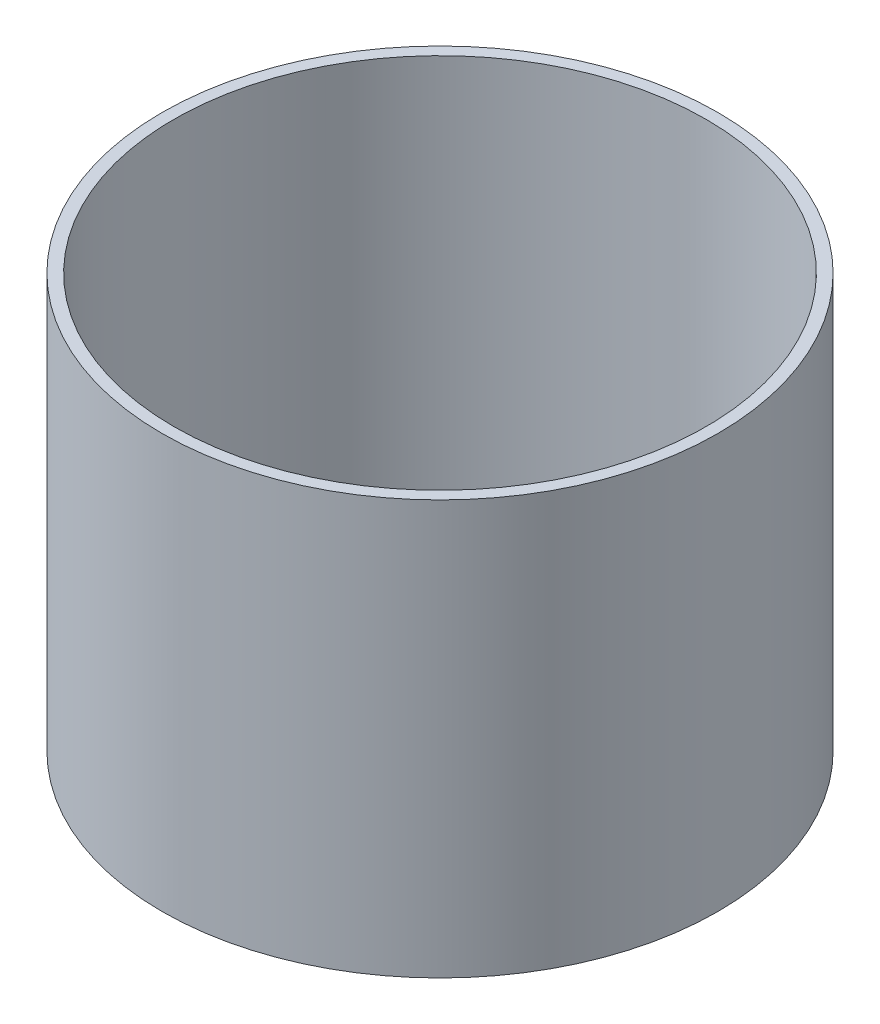
ISO-10303-21;
HEADER;
FILE_DESCRIPTION(('STEP AP214'),'2;1');
FILE_NAME('part.step','',(''),(''),'','','');
FILE_SCHEMA(('AUTOMOTIVE_DESIGN { 1 0 10303 214 1 1 1 1 }'));
ENDSEC;
DATA;
#1=APPLICATION_CONTEXT('core data for automotive mechanical design processes');
#2=APPLICATION_PROTOCOL_DEFINITION('international standard','automotive_design',2000,#1);
#3=PRODUCT_CONTEXT('',#1,'mechanical');
#4=PRODUCT('Part','Part','',(#3));
#5=PRODUCT_RELATED_PRODUCT_CATEGORY('part','',(#4));
#6=PRODUCT_DEFINITION_FORMATION('','',#4);
#7=PRODUCT_DEFINITION_CONTEXT('part definition',#1,'design');
#8=PRODUCT_DEFINITION('design','',#6,#7);
#9=PRODUCT_DEFINITION_SHAPE('','',#8);
#10=(LENGTH_UNIT() NAMED_UNIT(*) SI_UNIT(.MILLI.,.METRE.));
#11=(NAMED_UNIT(*) PLANE_ANGLE_UNIT() SI_UNIT($,.RADIAN.));
#12=(NAMED_UNIT(*) SI_UNIT($,.STERADIAN.) SOLID_ANGLE_UNIT());
#13=UNCERTAINTY_MEASURE_WITH_UNIT(LENGTH_MEASURE(1.E-05),#10,'distance_accuracy_value','');
#14=(GEOMETRIC_REPRESENTATION_CONTEXT(3) GLOBAL_UNCERTAINTY_ASSIGNED_CONTEXT((#13)) GLOBAL_UNIT_ASSIGNED_CONTEXT((#10,
#11,#12)) REPRESENTATION_CONTEXT('',''));
#15=CARTESIAN_POINT('',(0.,0.,0.));
#16=DIRECTION('',(0.,0.,1.));
#17=DIRECTION('',(1.,0.,0.));
#18=AXIS2_PLACEMENT_3D('',#15,#16,#17);
#19=CARTESIAN_POINT('',(0.,177.8,0.));
#20=DIRECTION('',(0.,1.,0.));
#21=DIRECTION('',(0.,0.,1.));
#22=AXIS2_PLACEMENT_3D('',#19,#20,#21);
#23=PLANE('',#22);
#24=CARTESIAN_POINT('',(0.,177.8,0.));
#25=DIRECTION('',(0.,1.,0.));
#26=DIRECTION('',(0.,0.,1.));
#27=AXIS2_PLACEMENT_3D('',#24,#25,#26);
#28=CIRCLE('',#27,119.38);
#29=CARTESIAN_POINT('',(0.,177.8,119.38));
#30=VERTEX_POINT('',#29);
#31=EDGE_CURVE('E11',#30,#30,#28,.T.);
#32=ORIENTED_EDGE('',*,*,#31,.T.);
#33=EDGE_LOOP('',(#32));
#34=FACE_BOUND('',#33,.T.);
#35=CARTESIAN_POINT('',(0.,177.8,0.));
#36=DIRECTION('',(0.,1.,0.));
#37=DIRECTION('',(0.,0.,1.));
#38=AXIS2_PLACEMENT_3D('',#35,#36,#37);
#39=CIRCLE('',#38,114.3);
#40=CARTESIAN_POINT('',(0.,177.8,114.3));
#41=VERTEX_POINT('',#40);
#42=EDGE_CURVE('E49',#41,#41,#39,.T.);
#43=ORIENTED_EDGE('',*,*,#42,.F.);
#44=EDGE_LOOP('',(#43));
#45=FACE_BOUND('',#44,.T.);
#46=ADVANCED_FACE('F38',(#34,#45),#23,.T.);
#47=CARTESIAN_POINT('',(0.,0.,0.));
#48=DIRECTION('',(0.,1.,0.));
#49=DIRECTION('',(0.,0.,1.));
#50=AXIS2_PLACEMENT_3D('',#47,#48,#49);
#51=PLANE('',#50);
#52=CARTESIAN_POINT('',(0.,0.,0.));
#53=DIRECTION('',(0.,1.,0.));
#54=DIRECTION('',(0.,0.,1.));
#55=AXIS2_PLACEMENT_3D('',#52,#53,#54);
#56=CIRCLE('',#55,119.38);
#57=CARTESIAN_POINT('',(0.,0.,119.38));
#58=VERTEX_POINT('',#57);
#59=EDGE_CURVE('E42',#58,#58,#56,.T.);
#60=ORIENTED_EDGE('',*,*,#59,.F.);
#61=EDGE_LOOP('',(#60));
#62=FACE_BOUND('',#61,.T.);
#63=CARTESIAN_POINT('',(0.,0.,0.));
#64=DIRECTION('',(0.,1.,0.));
#65=DIRECTION('',(0.,0.,1.));
#66=AXIS2_PLACEMENT_3D('',#63,#64,#65);
#67=CIRCLE('',#66,114.3);
#68=CARTESIAN_POINT('',(0.,0.,114.3));
#69=VERTEX_POINT('',#68);
#70=EDGE_CURVE('E51',#69,#69,#67,.T.);
#71=ORIENTED_EDGE('',*,*,#70,.T.);
#72=EDGE_LOOP('',(#71));
#73=FACE_BOUND('',#72,.T.);
#74=ADVANCED_FACE('F61',(#62,#73),#51,.F.);
#75=CARTESIAN_POINT('',(0.,177.8,0.));
#76=DIRECTION('',(0.,-1.,0.));
#77=DIRECTION('',(0.,0.,-1.));
#78=AXIS2_PLACEMENT_3D('',#75,#76,#77);
#79=CYLINDRICAL_SURFACE('',#78,119.38);
#80=ORIENTED_EDGE('',*,*,#31,.F.);
#81=EDGE_LOOP('',(#80));
#82=FACE_BOUND('',#81,.T.);
#83=ORIENTED_EDGE('',*,*,#59,.T.);
#84=EDGE_LOOP('',(#83));
#85=FACE_BOUND('',#84,.T.);
#86=ADVANCED_FACE('F40',(#82,#85),#79,.T.);
#87=CARTESIAN_POINT('',(0.,177.8,0.));
#88=DIRECTION('',(0.,-1.,0.));
#89=DIRECTION('',(0.,0.,-1.));
#90=AXIS2_PLACEMENT_3D('',#87,#88,#89);
#91=CYLINDRICAL_SURFACE('',#90,114.3);
#92=ORIENTED_EDGE('',*,*,#42,.T.);
#93=EDGE_LOOP('',(#92));
#94=FACE_BOUND('',#93,.T.);
#95=ORIENTED_EDGE('',*,*,#70,.F.);
#96=EDGE_LOOP('',(#95));
#97=FACE_BOUND('',#96,.T.);
#98=ADVANCED_FACE('F57',(#94,#97),#91,.F.);
#99=CLOSED_SHELL('',(#46,#74,#86,#98));
#100=MANIFOLD_SOLID_BREP('B2',#99);
#101=ADVANCED_BREP_SHAPE_REPRESENTATION('',(#18,#100),#14);
#102=SHAPE_DEFINITION_REPRESENTATION(#9,#101);
ENDSEC;
END-ISO-10303-21;
